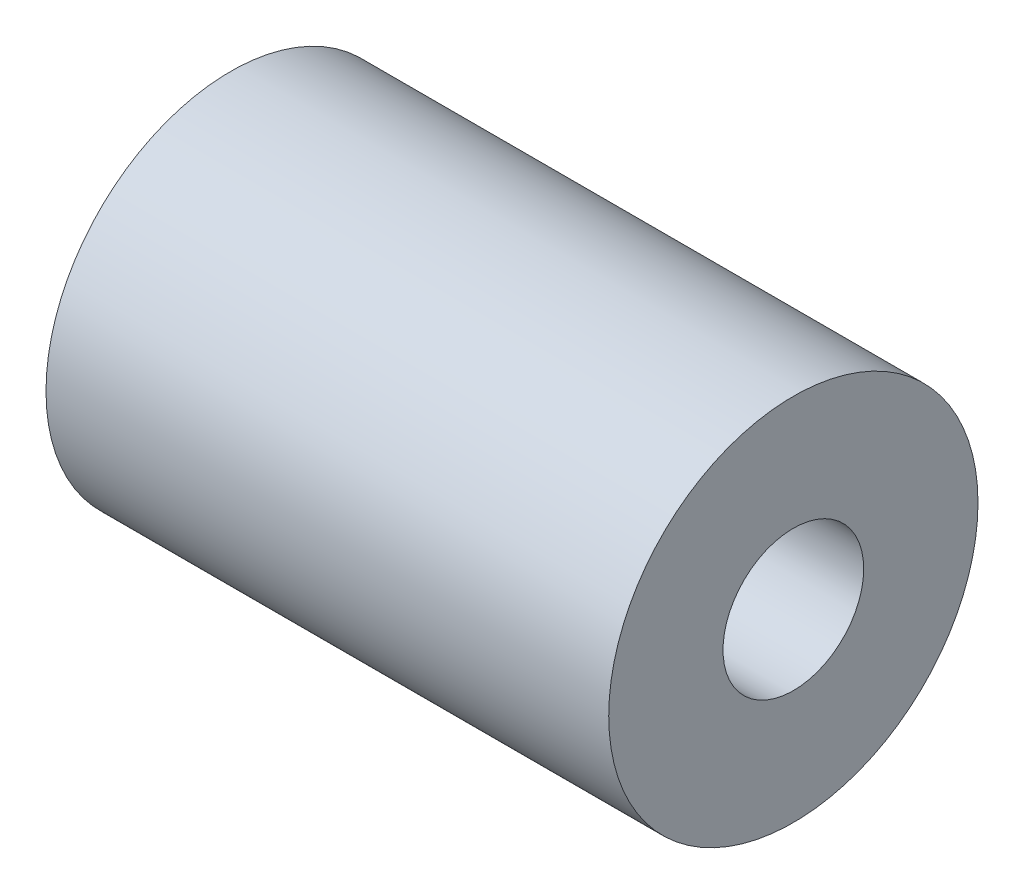
ISO-10303-21;
HEADER;
FILE_DESCRIPTION(('STEP AP214'),'2;1');
FILE_NAME('part.step','',(''),(''),'','','');
FILE_SCHEMA(('AUTOMOTIVE_DESIGN { 1 0 10303 214 1 1 1 1 }'));
ENDSEC;
DATA;
#1=APPLICATION_CONTEXT('core data for automotive mechanical design processes');
#2=APPLICATION_PROTOCOL_DEFINITION('international standard','automotive_design',2000,#1);
#3=PRODUCT_CONTEXT('',#1,'mechanical');
#4=PRODUCT('Part','Part','',(#3));
#5=PRODUCT_RELATED_PRODUCT_CATEGORY('part','',(#4));
#6=PRODUCT_DEFINITION_FORMATION('','',#4);
#7=PRODUCT_DEFINITION_CONTEXT('part definition',#1,'design');
#8=PRODUCT_DEFINITION('design','',#6,#7);
#9=PRODUCT_DEFINITION_SHAPE('','',#8);
#10=(LENGTH_UNIT() NAMED_UNIT(*) SI_UNIT(.MILLI.,.METRE.));
#11=(NAMED_UNIT(*) PLANE_ANGLE_UNIT() SI_UNIT($,.RADIAN.));
#12=(NAMED_UNIT(*) SI_UNIT($,.STERADIAN.) SOLID_ANGLE_UNIT());
#13=UNCERTAINTY_MEASURE_WITH_UNIT(LENGTH_MEASURE(1.E-05),#10,'distance_accuracy_value','');
#14=(GEOMETRIC_REPRESENTATION_CONTEXT(3) GLOBAL_UNCERTAINTY_ASSIGNED_CONTEXT((#13)) GLOBAL_UNIT_ASSIGNED_CONTEXT((#10,
#11,#12)) REPRESENTATION_CONTEXT('',''));
#15=CARTESIAN_POINT('',(0.,0.,0.));
#16=DIRECTION('',(0.,0.,1.));
#17=DIRECTION('',(1.,0.,0.));
#18=AXIS2_PLACEMENT_3D('',#15,#16,#17);
#19=CARTESIAN_POINT('',(50.8,0.,0.));
#20=DIRECTION('',(-1.,0.,0.));
#21=DIRECTION('',(0.,0.,1.));
#22=AXIS2_PLACEMENT_3D('',#19,#20,#21);
#23=CYLINDRICAL_SURFACE('',#22,16.66875);
#24=CARTESIAN_POINT('',(50.8,0.,0.));
#25=DIRECTION('',(1.,0.,0.));
#26=DIRECTION('',(0.,0.,-1.));
#27=AXIS2_PLACEMENT_3D('',#24,#25,#26);
#28=CIRCLE('',#27,16.66875);
#29=CARTESIAN_POINT('',(50.8,0.,-16.66875));
#30=VERTEX_POINT('',#29);
#31=EDGE_CURVE('E10',#30,#30,#28,.T.);
#32=ORIENTED_EDGE('',*,*,#31,.F.);
#33=EDGE_LOOP('',(#32));
#34=FACE_BOUND('',#33,.T.);
#35=CARTESIAN_POINT('',(0.,0.,0.));
#36=DIRECTION('',(1.,0.,0.));
#37=DIRECTION('',(0.,0.,-1.));
#38=AXIS2_PLACEMENT_3D('',#35,#36,#37);
#39=CIRCLE('',#38,16.66875);
#40=CARTESIAN_POINT('',(0.,0.,-16.66875));
#41=VERTEX_POINT('',#40);
#42=EDGE_CURVE('E37',#41,#41,#39,.T.);
#43=ORIENTED_EDGE('',*,*,#42,.T.);
#44=EDGE_LOOP('',(#43));
#45=FACE_BOUND('',#44,.T.);
#46=ADVANCED_FACE('F31',(#34,#45),#23,.T.);
#47=CARTESIAN_POINT('',(50.8,0.,0.));
#48=DIRECTION('',(1.,0.,0.));
#49=DIRECTION('',(0.,0.,-1.));
#50=AXIS2_PLACEMENT_3D('',#47,#48,#49);
#51=PLANE('',#50);
#52=CARTESIAN_POINT('',(50.8,0.,0.));
#53=DIRECTION('',(1.,0.,0.));
#54=DIRECTION('',(0.,0.,-1.));
#55=AXIS2_PLACEMENT_3D('',#52,#53,#54);
#56=CIRCLE('',#55,6.35);
#57=CARTESIAN_POINT('',(50.8,0.,-6.35));
#58=VERTEX_POINT('',#57);
#59=EDGE_CURVE('E41',#58,#58,#56,.T.);
#60=ORIENTED_EDGE('',*,*,#59,.F.);
#61=EDGE_LOOP('',(#60));
#62=FACE_BOUND('',#61,.T.);
#63=ORIENTED_EDGE('',*,*,#31,.T.);
#64=EDGE_LOOP('',(#63));
#65=FACE_BOUND('',#64,.T.);
#66=ADVANCED_FACE('F63',(#62,#65),#51,.T.);
#67=CARTESIAN_POINT('',(0.,0.,0.));
#68=DIRECTION('',(1.,0.,0.));
#69=DIRECTION('',(0.,0.,-1.));
#70=AXIS2_PLACEMENT_3D('',#67,#68,#69);
#71=PLANE('',#70);
#72=CARTESIAN_POINT('',(0.,0.,0.));
#73=DIRECTION('',(-1.,0.,0.));
#74=DIRECTION('',(0.,0.,1.));
#75=AXIS2_PLACEMENT_3D('',#72,#73,#74);
#76=CIRCLE('',#75,7.9375);
#77=CARTESIAN_POINT('',(0.,0.,7.9375));
#78=VERTEX_POINT('',#77);
#79=EDGE_CURVE('E53',#78,#78,#76,.T.);
#80=ORIENTED_EDGE('',*,*,#79,.F.);
#81=EDGE_LOOP('',(#80));
#82=FACE_BOUND('',#81,.T.);
#83=ORIENTED_EDGE('',*,*,#42,.F.);
#84=EDGE_LOOP('',(#83));
#85=FACE_BOUND('',#84,.T.);
#86=ADVANCED_FACE('F59',(#82,#85),#71,.F.);
#87=CARTESIAN_POINT('',(25.4,0.,0.));
#88=DIRECTION('',(1.,0.,0.));
#89=DIRECTION('',(0.,0.,-1.));
#90=AXIS2_PLACEMENT_3D('',#87,#88,#89);
#91=CYLINDRICAL_SURFACE('',#90,6.35);
#92=CARTESIAN_POINT('',(25.4,0.,0.));
#93=DIRECTION('',(-1.,0.,0.));
#94=DIRECTION('',(0.,0.,1.));
#95=AXIS2_PLACEMENT_3D('',#92,#93,#94);
#96=CIRCLE('',#95,6.35);
#97=CARTESIAN_POINT('',(25.4,0.,6.35));
#98=VERTEX_POINT('',#97);
#99=EDGE_CURVE('E45',#98,#98,#96,.F.);
#100=ORIENTED_EDGE('',*,*,#99,.F.);
#101=EDGE_LOOP('',(#100));
#102=FACE_BOUND('',#101,.T.);
#103=ORIENTED_EDGE('',*,*,#59,.T.);
#104=EDGE_LOOP('',(#103));
#105=FACE_BOUND('',#104,.T.);
#106=ADVANCED_FACE('F62',(#102,#105),#91,.F.);
#107=CARTESIAN_POINT('',(25.4,0.,0.));
#108=DIRECTION('',(-1.,0.,0.));
#109=DIRECTION('',(0.,0.,1.));
#110=AXIS2_PLACEMENT_3D('',#107,#108,#109);
#111=PLANE('',#110);
#112=CARTESIAN_POINT('',(25.4,0.,0.));
#113=DIRECTION('',(-1.,0.,0.));
#114=DIRECTION('',(0.,0.,1.));
#115=AXIS2_PLACEMENT_3D('',#112,#113,#114);
#116=CIRCLE('',#115,7.9375);
#117=CARTESIAN_POINT('',(25.4,0.,7.9375));
#118=VERTEX_POINT('',#117);
#119=EDGE_CURVE('E50',#118,#118,#116,.T.);
#120=ORIENTED_EDGE('',*,*,#119,.T.);
#121=EDGE_LOOP('',(#120));
#122=FACE_BOUND('',#121,.T.);
#123=ORIENTED_EDGE('',*,*,#99,.T.);
#124=EDGE_LOOP('',(#123));
#125=FACE_BOUND('',#124,.T.);
#126=ADVANCED_FACE('F69',(#122,#125),#111,.T.);
#127=CARTESIAN_POINT('',(25.4,0.,0.));
#128=DIRECTION('',(-1.,0.,0.));
#129=DIRECTION('',(0.,0.,1.));
#130=AXIS2_PLACEMENT_3D('',#127,#128,#129);
#131=CYLINDRICAL_SURFACE('',#130,7.9375);
#132=ORIENTED_EDGE('',*,*,#119,.F.);
#133=EDGE_LOOP('',(#132));
#134=FACE_BOUND('',#133,.T.);
#135=ORIENTED_EDGE('',*,*,#79,.T.);
#136=EDGE_LOOP('',(#135));
#137=FACE_BOUND('',#136,.T.);
#138=ADVANCED_FACE('F57',(#134,#137),#131,.F.);
#139=CLOSED_SHELL('',(#46,#66,#86,#106,#126,#138));
#140=MANIFOLD_SOLID_BREP('B2',#139);
#141=ADVANCED_BREP_SHAPE_REPRESENTATION('',(#18,#140),#14);
#142=SHAPE_DEFINITION_REPRESENTATION(#9,#141);
ENDSEC;
END-ISO-10303-21;
